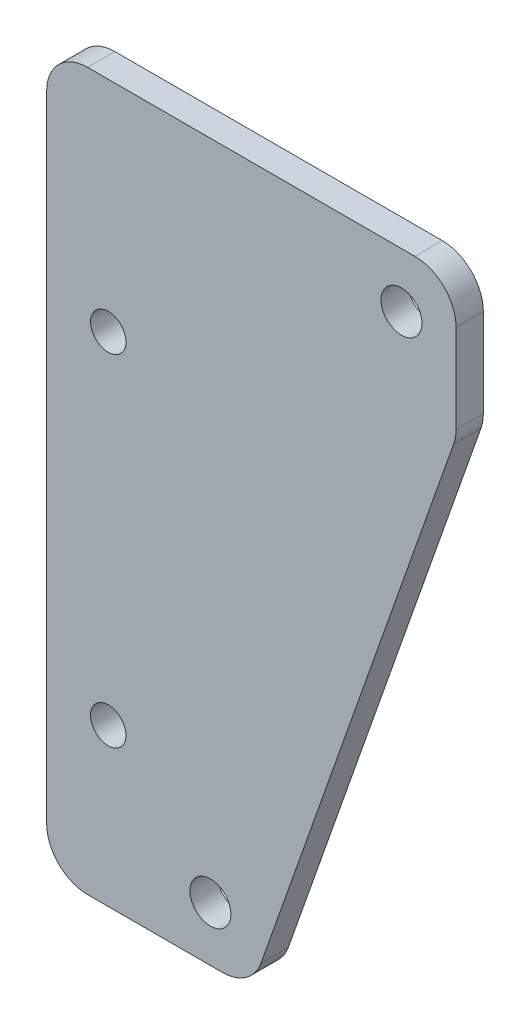
ISO-10303-21;
HEADER;
FILE_DESCRIPTION(('STEP AP214'),'2;1');
FILE_NAME('part.step','',(''),(''),'','','');
FILE_SCHEMA(('AUTOMOTIVE_DESIGN { 1 0 10303 214 1 1 1 1 }'));
ENDSEC;
DATA;
#1=APPLICATION_CONTEXT('core data for automotive mechanical design processes');
#2=APPLICATION_PROTOCOL_DEFINITION('international standard','automotive_design',2000,#1);
#3=PRODUCT_CONTEXT('',#1,'mechanical');
#4=PRODUCT('Part','Part','',(#3));
#5=PRODUCT_RELATED_PRODUCT_CATEGORY('part','',(#4));
#6=PRODUCT_DEFINITION_FORMATION('','',#4);
#7=PRODUCT_DEFINITION_CONTEXT('part definition',#1,'design');
#8=PRODUCT_DEFINITION('design','',#6,#7);
#9=PRODUCT_DEFINITION_SHAPE('','',#8);
#10=(LENGTH_UNIT() NAMED_UNIT(*) SI_UNIT(.MILLI.,.METRE.));
#11=(NAMED_UNIT(*) PLANE_ANGLE_UNIT() SI_UNIT($,.RADIAN.));
#12=(NAMED_UNIT(*) SI_UNIT($,.STERADIAN.) SOLID_ANGLE_UNIT());
#13=UNCERTAINTY_MEASURE_WITH_UNIT(LENGTH_MEASURE(1.E-05),#10,'distance_accuracy_value','');
#14=(GEOMETRIC_REPRESENTATION_CONTEXT(3) GLOBAL_UNCERTAINTY_ASSIGNED_CONTEXT((#13)) GLOBAL_UNIT_ASSIGNED_CONTEXT((#10,
#11,#12)) REPRESENTATION_CONTEXT('',''));
#15=CARTESIAN_POINT('',(0.,0.,0.));
#16=DIRECTION('',(0.,0.,1.));
#17=DIRECTION('',(1.,0.,0.));
#18=AXIS2_PLACEMENT_3D('',#15,#16,#17);
#19=CARTESIAN_POINT('',(0.,0.,2.));
#20=DIRECTION('',(0.,0.,1.));
#21=DIRECTION('',(1.,0.,0.));
#22=AXIS2_PLACEMENT_3D('',#19,#20,#21);
#23=PLANE('',#22);
#24=CARTESIAN_POINT('',(4.51504062206895,-41.,2.));
#25=DIRECTION('',(0.,0.,1.));
#26=DIRECTION('',(1.,0.,0.));
#27=AXIS2_PLACEMENT_3D('',#24,#25,#26);
#28=CIRCLE('',#27,1.3);
#29=CARTESIAN_POINT('',(5.81504062206895,-41.,2.));
#30=VERTEX_POINT('',#29);
#31=EDGE_CURVE('E222',#30,#30,#28,.T.);
#32=ORIENTED_EDGE('',*,*,#31,.F.);
#33=EDGE_LOOP('',(#32));
#34=FACE_BOUND('',#33,.T.);
#35=CARTESIAN_POINT('',(26.,-4.,2.));
#36=DIRECTION('',(0.,0.,1.));
#37=DIRECTION('',(1.,0.,0.));
#38=AXIS2_PLACEMENT_3D('',#35,#36,#37);
#39=CIRCLE('',#38,1.5);
#40=CARTESIAN_POINT('',(27.5,-4.,2.));
#41=VERTEX_POINT('',#40);
#42=EDGE_CURVE('E147',#41,#41,#39,.T.);
#43=ORIENTED_EDGE('',*,*,#42,.F.);
#44=EDGE_LOOP('',(#43));
#45=FACE_BOUND('',#44,.T.);
#46=DIRECTION('',(0.332820117735137,0.94299033358289,0.));
#47=VECTOR('',#46,1.);
#48=CARTESIAN_POINT('',(15.,-52.5,2.));
#49=LINE('',#48,#47);
#50=CARTESIAN_POINT('',(15.7064257576922,-50.4984603532054,2.));
#51=VERTEX_POINT('',#50);
#52=CARTESIAN_POINT('',(29.8289710007487,-10.4845821645454,2.));
#53=VERTEX_POINT('',#52);
#54=EDGE_CURVE('E156',#51,#53,#49,.T.);
#55=ORIENTED_EDGE('',*,*,#54,.T.);
#56=CARTESIAN_POINT('',(27.,-9.48612181134004,2.));
#57=DIRECTION('',(0.,0.,1.));
#58=DIRECTION('',(1.,0.,0.));
#59=AXIS2_PLACEMENT_3D('',#56,#57,#58);
#60=CIRCLE('',#59,3.);
#61=CARTESIAN_POINT('',(30.,-9.48612181134004,2.));
#62=VERTEX_POINT('',#61);
#63=EDGE_CURVE('E182',#53,#62,#60,.T.);
#64=ORIENTED_EDGE('',*,*,#63,.T.);
#65=DIRECTION('',(0.,1.,0.));
#66=VECTOR('',#65,1.);
#67=CARTESIAN_POINT('',(30.,-10.,2.));
#68=LINE('',#67,#66);
#69=CARTESIAN_POINT('',(30.,-3.,2.));
#70=VERTEX_POINT('',#69);
#71=EDGE_CURVE('E139',#62,#70,#68,.T.);
#72=ORIENTED_EDGE('',*,*,#71,.T.);
#73=CARTESIAN_POINT('',(27.,-3.,2.));
#74=DIRECTION('',(0.,0.,1.));
#75=DIRECTION('',(1.,0.,0.));
#76=AXIS2_PLACEMENT_3D('',#73,#74,#75);
#77=CIRCLE('',#76,3.);
#78=CARTESIAN_POINT('',(27.,0.,2.));
#79=VERTEX_POINT('',#78);
#80=EDGE_CURVE('E180',#70,#79,#77,.T.);
#81=ORIENTED_EDGE('',*,*,#80,.T.);
#82=DIRECTION('',(-1.,0.,0.));
#83=VECTOR('',#82,1.);
#84=CARTESIAN_POINT('',(30.,0.,2.));
#85=LINE('',#84,#83);
#86=CARTESIAN_POINT('',(3.,0.,2.));
#87=VERTEX_POINT('',#86);
#88=EDGE_CURVE('E210',#79,#87,#85,.T.);
#89=ORIENTED_EDGE('',*,*,#88,.T.);
#90=CARTESIAN_POINT('',(3.,-3.,2.));
#91=DIRECTION('',(0.,0.,1.));
#92=DIRECTION('',(1.,0.,0.));
#93=AXIS2_PLACEMENT_3D('',#90,#91,#92);
#94=CIRCLE('',#93,3.);
#95=CARTESIAN_POINT('',(0.,-3.,2.));
#96=VERTEX_POINT('',#95);
#97=EDGE_CURVE('E178',#87,#96,#94,.T.);
#98=ORIENTED_EDGE('',*,*,#97,.T.);
#99=DIRECTION('',(0.,-1.,0.));
#100=VECTOR('',#99,1.);
#101=CARTESIAN_POINT('',(0.,0.,2.));
#102=LINE('',#101,#100);
#103=CARTESIAN_POINT('',(0.,-49.5,2.));
#104=VERTEX_POINT('',#103);
#105=EDGE_CURVE('E199',#96,#104,#102,.T.);
#106=ORIENTED_EDGE('',*,*,#105,.T.);
#107=CARTESIAN_POINT('',(3.00000000000001,-49.5,2.));
#108=DIRECTION('',(0.,0.,1.));
#109=DIRECTION('',(1.,0.,0.));
#110=AXIS2_PLACEMENT_3D('',#107,#108,#109);
#111=CIRCLE('',#110,3.);
#112=CARTESIAN_POINT('',(3.00000000000001,-52.5,2.));
#113=VERTEX_POINT('',#112);
#114=EDGE_CURVE('E62',#104,#113,#111,.T.);
#115=ORIENTED_EDGE('',*,*,#114,.T.);
#116=DIRECTION('',(1.,0.,0.));
#117=VECTOR('',#116,1.);
#118=CARTESIAN_POINT('',(0.,-52.5,2.));
#119=LINE('',#118,#117);
#120=CARTESIAN_POINT('',(12.8774547569435,-52.5,2.));
#121=VERTEX_POINT('',#120);
#122=EDGE_CURVE('E207',#113,#121,#119,.T.);
#123=ORIENTED_EDGE('',*,*,#122,.T.);
#124=CARTESIAN_POINT('',(12.8774547569435,-49.5,2.));
#125=DIRECTION('',(0.,0.,1.));
#126=DIRECTION('',(1.,0.,0.));
#127=AXIS2_PLACEMENT_3D('',#124,#125,#126);
#128=CIRCLE('',#127,3.);
#129=EDGE_CURVE('E175',#121,#51,#128,.T.);
#130=ORIENTED_EDGE('',*,*,#129,.T.);
#131=EDGE_LOOP('',(#55,#64,#72,#81,#89,#98,#106,#115,#123,#130));
#132=FACE_BOUND('',#131,.T.);
#133=CARTESIAN_POINT('',(12.,-48.5,2.));
#134=DIRECTION('',(0.,0.,1.));
#135=DIRECTION('',(1.,0.,0.));
#136=AXIS2_PLACEMENT_3D('',#133,#134,#135);
#137=CIRCLE('',#136,1.5);
#138=CARTESIAN_POINT('',(13.5,-48.5,2.));
#139=VERTEX_POINT('',#138);
#140=EDGE_CURVE('E217',#139,#139,#137,.T.);
#141=ORIENTED_EDGE('',*,*,#140,.F.);
#142=EDGE_LOOP('',(#141));
#143=FACE_BOUND('',#142,.T.);
#144=CARTESIAN_POINT('',(4.51504062206895,-16.0288945453507,2.));
#145=DIRECTION('',(0.,0.,1.));
#146=DIRECTION('',(1.,0.,0.));
#147=AXIS2_PLACEMENT_3D('',#144,#145,#146);
#148=CIRCLE('',#147,1.3);
#149=CARTESIAN_POINT('',(5.81504062206895,-16.0288945453507,2.));
#150=VERTEX_POINT('',#149);
#151=EDGE_CURVE('E228',#150,#150,#148,.T.);
#152=ORIENTED_EDGE('',*,*,#151,.F.);
#153=EDGE_LOOP('',(#152));
#154=FACE_BOUND('',#153,.T.);
#155=ADVANCED_FACE('F41',(#34,#45,#132,#143,#154),#23,.T.);
#156=CARTESIAN_POINT('',(0.,0.,0.));
#157=DIRECTION('',(0.,0.,1.));
#158=DIRECTION('',(1.,0.,0.));
#159=AXIS2_PLACEMENT_3D('',#156,#157,#158);
#160=PLANE('',#159);
#161=DIRECTION('',(0.,1.,0.));
#162=VECTOR('',#161,1.);
#163=CARTESIAN_POINT('',(30.,-10.,0.));
#164=LINE('',#163,#162);
#165=CARTESIAN_POINT('',(30.,-9.48612181134004,0.));
#166=VERTEX_POINT('',#165);
#167=CARTESIAN_POINT('',(30.,-3.,0.));
#168=VERTEX_POINT('',#167);
#169=EDGE_CURVE('E136',#166,#168,#164,.T.);
#170=ORIENTED_EDGE('',*,*,#169,.F.);
#171=CARTESIAN_POINT('',(27.,-9.48612181134004,0.));
#172=DIRECTION('',(0.,0.,1.));
#173=DIRECTION('',(1.,0.,0.));
#174=AXIS2_PLACEMENT_3D('',#171,#172,#173);
#175=CIRCLE('',#174,3.);
#176=CARTESIAN_POINT('',(29.8289710007487,-10.4845821645454,0.));
#177=VERTEX_POINT('',#176);
#178=EDGE_CURVE('E119',#166,#177,#175,.F.);
#179=ORIENTED_EDGE('',*,*,#178,.T.);
#180=DIRECTION('',(0.332820117735137,0.94299033358289,0.));
#181=VECTOR('',#180,1.);
#182=CARTESIAN_POINT('',(15.,-52.5,0.));
#183=LINE('',#182,#181);
#184=CARTESIAN_POINT('',(15.7064257576922,-50.4984603532054,0.));
#185=VERTEX_POINT('',#184);
#186=EDGE_CURVE('E163',#185,#177,#183,.T.);
#187=ORIENTED_EDGE('',*,*,#186,.F.);
#188=CARTESIAN_POINT('',(12.8774547569435,-49.5,0.));
#189=DIRECTION('',(0.,0.,1.));
#190=DIRECTION('',(1.,0.,0.));
#191=AXIS2_PLACEMENT_3D('',#188,#189,#190);
#192=CIRCLE('',#191,3.);
#193=CARTESIAN_POINT('',(12.8774547569435,-52.5,0.));
#194=VERTEX_POINT('',#193);
#195=EDGE_CURVE('E140',#185,#194,#192,.F.);
#196=ORIENTED_EDGE('',*,*,#195,.T.);
#197=DIRECTION('',(1.,0.,0.));
#198=VECTOR('',#197,1.);
#199=CARTESIAN_POINT('',(0.,-52.5,0.));
#200=LINE('',#199,#198);
#201=CARTESIAN_POINT('',(3.00000000000001,-52.5,0.));
#202=VERTEX_POINT('',#201);
#203=EDGE_CURVE('E161',#202,#194,#200,.T.);
#204=ORIENTED_EDGE('',*,*,#203,.F.);
#205=CARTESIAN_POINT('',(3.00000000000001,-49.5,0.));
#206=DIRECTION('',(0.,0.,1.));
#207=DIRECTION('',(1.,0.,0.));
#208=AXIS2_PLACEMENT_3D('',#205,#206,#207);
#209=CIRCLE('',#208,3.);
#210=CARTESIAN_POINT('',(0.,-49.5,0.));
#211=VERTEX_POINT('',#210);
#212=EDGE_CURVE('E167',#202,#211,#209,.F.);
#213=ORIENTED_EDGE('',*,*,#212,.T.);
#214=DIRECTION('',(0.,-1.,0.));
#215=VECTOR('',#214,1.);
#216=CARTESIAN_POINT('',(0.,0.,0.));
#217=LINE('',#216,#215);
#218=CARTESIAN_POINT('',(0.,-3.,0.));
#219=VERTEX_POINT('',#218);
#220=EDGE_CURVE('E150',#219,#211,#217,.T.);
#221=ORIENTED_EDGE('',*,*,#220,.F.);
#222=CARTESIAN_POINT('',(3.,-3.,0.));
#223=DIRECTION('',(0.,0.,1.));
#224=DIRECTION('',(1.,0.,0.));
#225=AXIS2_PLACEMENT_3D('',#222,#223,#224);
#226=CIRCLE('',#225,3.);
#227=CARTESIAN_POINT('',(3.,0.,0.));
#228=VERTEX_POINT('',#227);
#229=EDGE_CURVE('E169',#219,#228,#226,.F.);
#230=ORIENTED_EDGE('',*,*,#229,.T.);
#231=DIRECTION('',(-1.,0.,0.));
#232=VECTOR('',#231,1.);
#233=CARTESIAN_POINT('',(30.,0.,0.));
#234=LINE('',#233,#232);
#235=CARTESIAN_POINT('',(27.,0.,0.));
#236=VERTEX_POINT('',#235);
#237=EDGE_CURVE('E146',#236,#228,#234,.T.);
#238=ORIENTED_EDGE('',*,*,#237,.F.);
#239=CARTESIAN_POINT('',(27.,-3.,0.));
#240=DIRECTION('',(0.,0.,1.));
#241=DIRECTION('',(1.,0.,0.));
#242=AXIS2_PLACEMENT_3D('',#239,#240,#241);
#243=CIRCLE('',#242,3.);
#244=EDGE_CURVE('E130',#236,#168,#243,.F.);
#245=ORIENTED_EDGE('',*,*,#244,.T.);
#246=EDGE_LOOP('',(#170,#179,#187,#196,#204,#213,#221,#230,#238,#245));
#247=FACE_BOUND('',#246,.T.);
#248=CARTESIAN_POINT('',(26.,-4.,0.));
#249=DIRECTION('',(0.,0.,1.));
#250=DIRECTION('',(1.,0.,0.));
#251=AXIS2_PLACEMENT_3D('',#248,#249,#250);
#252=CIRCLE('',#251,1.5);
#253=CARTESIAN_POINT('',(27.5,-4.,0.));
#254=VERTEX_POINT('',#253);
#255=EDGE_CURVE('E153',#254,#254,#252,.T.);
#256=ORIENTED_EDGE('',*,*,#255,.T.);
#257=EDGE_LOOP('',(#256));
#258=FACE_BOUND('',#257,.T.);
#259=CARTESIAN_POINT('',(12.,-48.5,0.));
#260=DIRECTION('',(0.,0.,1.));
#261=DIRECTION('',(1.,0.,0.));
#262=AXIS2_PLACEMENT_3D('',#259,#260,#261);
#263=CIRCLE('',#262,1.5);
#264=CARTESIAN_POINT('',(13.5,-48.5,0.));
#265=VERTEX_POINT('',#264);
#266=EDGE_CURVE('E219',#265,#265,#263,.T.);
#267=ORIENTED_EDGE('',*,*,#266,.T.);
#268=EDGE_LOOP('',(#267));
#269=FACE_BOUND('',#268,.T.);
#270=CARTESIAN_POINT('',(4.51504062206895,-41.,0.));
#271=DIRECTION('',(0.,0.,1.));
#272=DIRECTION('',(1.,0.,0.));
#273=AXIS2_PLACEMENT_3D('',#270,#271,#272);
#274=CIRCLE('',#273,1.3);
#275=CARTESIAN_POINT('',(5.81504062206895,-41.,0.));
#276=VERTEX_POINT('',#275);
#277=EDGE_CURVE('E225',#276,#276,#274,.T.);
#278=ORIENTED_EDGE('',*,*,#277,.T.);
#279=EDGE_LOOP('',(#278));
#280=FACE_BOUND('',#279,.T.);
#281=CARTESIAN_POINT('',(4.51504062206895,-16.0288945453507,0.));
#282=DIRECTION('',(0.,0.,1.));
#283=DIRECTION('',(1.,0.,0.));
#284=AXIS2_PLACEMENT_3D('',#281,#282,#283);
#285=CIRCLE('',#284,1.3);
#286=CARTESIAN_POINT('',(5.81504062206895,-16.0288945453507,0.));
#287=VERTEX_POINT('',#286);
#288=EDGE_CURVE('E231',#287,#287,#285,.T.);
#289=ORIENTED_EDGE('',*,*,#288,.T.);
#290=EDGE_LOOP('',(#289));
#291=FACE_BOUND('',#290,.T.);
#292=ADVANCED_FACE('F143',(#247,#258,#269,#280,#291),#160,.F.);
#293=CARTESIAN_POINT('',(30.,-10.,2.));
#294=DIRECTION('',(-1.,0.,0.));
#295=DIRECTION('',(0.,0.,1.));
#296=AXIS2_PLACEMENT_3D('',#293,#294,#295);
#297=PLANE('',#296);
#298=ORIENTED_EDGE('',*,*,#71,.F.);
#299=DIRECTION('',(0.,0.,-1.));
#300=VECTOR('',#299,1.);
#301=CARTESIAN_POINT('',(30.,-9.48612181134004,2.));
#302=LINE('',#301,#300);
#303=EDGE_CURVE('E123',#62,#166,#302,.T.);
#304=ORIENTED_EDGE('',*,*,#303,.T.);
#305=ORIENTED_EDGE('',*,*,#169,.T.);
#306=DIRECTION('',(0.,0.,-1.));
#307=VECTOR('',#306,1.);
#308=CARTESIAN_POINT('',(30.,-3.,2.));
#309=LINE('',#308,#307);
#310=EDGE_CURVE('E141',#168,#70,#309,.F.);
#311=ORIENTED_EDGE('',*,*,#310,.T.);
#312=EDGE_LOOP('',(#298,#304,#305,#311));
#313=FACE_BOUND('',#312,.T.);
#314=ADVANCED_FACE('F135',(#313),#297,.F.);
#315=CARTESIAN_POINT('',(30.,0.,2.));
#316=DIRECTION('',(0.,-1.,0.));
#317=DIRECTION('',(0.,0.,-1.));
#318=AXIS2_PLACEMENT_3D('',#315,#316,#317);
#319=PLANE('',#318);
#320=ORIENTED_EDGE('',*,*,#88,.F.);
#321=DIRECTION('',(0.,0.,-1.));
#322=VECTOR('',#321,1.);
#323=CARTESIAN_POINT('',(27.,0.,2.));
#324=LINE('',#323,#322);
#325=EDGE_CURVE('E186',#79,#236,#324,.T.);
#326=ORIENTED_EDGE('',*,*,#325,.T.);
#327=ORIENTED_EDGE('',*,*,#237,.T.);
#328=DIRECTION('',(0.,0.,-1.));
#329=VECTOR('',#328,1.);
#330=CARTESIAN_POINT('',(3.,0.,2.));
#331=LINE('',#330,#329);
#332=EDGE_CURVE('E184',#228,#87,#331,.F.);
#333=ORIENTED_EDGE('',*,*,#332,.T.);
#334=EDGE_LOOP('',(#320,#326,#327,#333));
#335=FACE_BOUND('',#334,.T.);
#336=ADVANCED_FACE('F261',(#335),#319,.F.);
#337=CARTESIAN_POINT('',(0.,0.,2.));
#338=DIRECTION('',(1.,0.,0.));
#339=DIRECTION('',(0.,1.,0.));
#340=AXIS2_PLACEMENT_3D('',#337,#338,#339);
#341=PLANE('',#340);
#342=ORIENTED_EDGE('',*,*,#105,.F.);
#343=DIRECTION('',(0.,0.,-1.));
#344=VECTOR('',#343,1.);
#345=CARTESIAN_POINT('',(0.,-3.,2.));
#346=LINE('',#345,#344);
#347=EDGE_CURVE('E191',#96,#219,#346,.T.);
#348=ORIENTED_EDGE('',*,*,#347,.T.);
#349=ORIENTED_EDGE('',*,*,#220,.T.);
#350=DIRECTION('',(0.,0.,-1.));
#351=VECTOR('',#350,1.);
#352=CARTESIAN_POINT('',(0.,-49.5,2.));
#353=LINE('',#352,#351);
#354=EDGE_CURVE('E189',#211,#104,#353,.F.);
#355=ORIENTED_EDGE('',*,*,#354,.T.);
#356=EDGE_LOOP('',(#342,#348,#349,#355));
#357=FACE_BOUND('',#356,.T.);
#358=ADVANCED_FACE('F197',(#357),#341,.F.);
#359=CARTESIAN_POINT('',(0.,-52.5,2.));
#360=DIRECTION('',(0.,1.,0.));
#361=DIRECTION('',(-1.,0.,0.));
#362=AXIS2_PLACEMENT_3D('',#359,#360,#361);
#363=PLANE('',#362);
#364=ORIENTED_EDGE('',*,*,#122,.F.);
#365=DIRECTION('',(0.,0.,-1.));
#366=VECTOR('',#365,1.);
#367=CARTESIAN_POINT('',(3.00000000000001,-52.5,2.));
#368=LINE('',#367,#366);
#369=EDGE_CURVE('E11',#113,#202,#368,.T.);
#370=ORIENTED_EDGE('',*,*,#369,.T.);
#371=ORIENTED_EDGE('',*,*,#203,.T.);
#372=DIRECTION('',(0.,0.,-1.));
#373=VECTOR('',#372,1.);
#374=CARTESIAN_POINT('',(12.8774547569435,-52.5,2.));
#375=LINE('',#374,#373);
#376=EDGE_CURVE('E49',#194,#121,#375,.F.);
#377=ORIENTED_EDGE('',*,*,#376,.T.);
#378=EDGE_LOOP('',(#364,#370,#371,#377));
#379=FACE_BOUND('',#378,.T.);
#380=ADVANCED_FACE('F206',(#379),#363,.F.);
#381=CARTESIAN_POINT('',(15.,-52.5,2.));
#382=DIRECTION('',(-0.94299033358289,0.332820117735137,0.));
#383=DIRECTION('',(-0.332820117735137,-0.94299033358289,0.));
#384=AXIS2_PLACEMENT_3D('',#381,#382,#383);
#385=PLANE('',#384);
#386=ORIENTED_EDGE('',*,*,#186,.T.);
#387=DIRECTION('',(0.,0.,-1.));
#388=VECTOR('',#387,1.);
#389=CARTESIAN_POINT('',(29.8289710007487,-10.4845821645454,2.));
#390=LINE('',#389,#388);
#391=EDGE_CURVE('E124',#177,#53,#390,.F.);
#392=ORIENTED_EDGE('',*,*,#391,.T.);
#393=ORIENTED_EDGE('',*,*,#54,.F.);
#394=DIRECTION('',(0.,0.,-1.));
#395=VECTOR('',#394,1.);
#396=CARTESIAN_POINT('',(15.7064257576922,-50.4984603532054,2.));
#397=LINE('',#396,#395);
#398=EDGE_CURVE('E129',#51,#185,#397,.T.);
#399=ORIENTED_EDGE('',*,*,#398,.T.);
#400=EDGE_LOOP('',(#386,#392,#393,#399));
#401=FACE_BOUND('',#400,.T.);
#402=ADVANCED_FACE('F253',(#401),#385,.F.);
#403=CARTESIAN_POINT('',(26.,-4.,2.));
#404=DIRECTION('',(0.,0.,-1.));
#405=DIRECTION('',(-1.,0.,0.));
#406=AXIS2_PLACEMENT_3D('',#403,#404,#405);
#407=CYLINDRICAL_SURFACE('',#406,1.5);
#408=ORIENTED_EDGE('',*,*,#42,.T.);
#409=EDGE_LOOP('',(#408));
#410=FACE_BOUND('',#409,.T.);
#411=ORIENTED_EDGE('',*,*,#255,.F.);
#412=EDGE_LOOP('',(#411));
#413=FACE_BOUND('',#412,.T.);
#414=ADVANCED_FACE('F250',(#410,#413),#407,.F.);
#415=CARTESIAN_POINT('',(12.,-48.5,2.));
#416=DIRECTION('',(0.,0.,-1.));
#417=DIRECTION('',(-1.,0.,0.));
#418=AXIS2_PLACEMENT_3D('',#415,#416,#417);
#419=CYLINDRICAL_SURFACE('',#418,1.5);
#420=ORIENTED_EDGE('',*,*,#140,.T.);
#421=EDGE_LOOP('',(#420));
#422=FACE_BOUND('',#421,.T.);
#423=ORIENTED_EDGE('',*,*,#266,.F.);
#424=EDGE_LOOP('',(#423));
#425=FACE_BOUND('',#424,.T.);
#426=ADVANCED_FACE('F291',(#422,#425),#419,.F.);
#427=CARTESIAN_POINT('',(4.51504062206895,-41.,2.));
#428=DIRECTION('',(0.,0.,-1.));
#429=DIRECTION('',(-1.,0.,0.));
#430=AXIS2_PLACEMENT_3D('',#427,#428,#429);
#431=CYLINDRICAL_SURFACE('',#430,1.3);
#432=ORIENTED_EDGE('',*,*,#31,.T.);
#433=EDGE_LOOP('',(#432));
#434=FACE_BOUND('',#433,.T.);
#435=ORIENTED_EDGE('',*,*,#277,.F.);
#436=EDGE_LOOP('',(#435));
#437=FACE_BOUND('',#436,.T.);
#438=ADVANCED_FACE('F294',(#434,#437),#431,.F.);
#439=CARTESIAN_POINT('',(4.51504062206895,-16.0288945453507,2.));
#440=DIRECTION('',(0.,0.,-1.));
#441=DIRECTION('',(-1.,0.,0.));
#442=AXIS2_PLACEMENT_3D('',#439,#440,#441);
#443=CYLINDRICAL_SURFACE('',#442,1.3);
#444=ORIENTED_EDGE('',*,*,#151,.T.);
#445=EDGE_LOOP('',(#444));
#446=FACE_BOUND('',#445,.T.);
#447=ORIENTED_EDGE('',*,*,#288,.F.);
#448=EDGE_LOOP('',(#447));
#449=FACE_BOUND('',#448,.T.);
#450=ADVANCED_FACE('F237',(#446,#449),#443,.F.);
#451=CARTESIAN_POINT('',(27.,-9.48612181134004,2.));
#452=DIRECTION('',(0.,0.,-1.));
#453=DIRECTION('',(-1.,0.,0.));
#454=AXIS2_PLACEMENT_3D('',#451,#452,#453);
#455=CYLINDRICAL_SURFACE('',#454,3.);
#456=ORIENTED_EDGE('',*,*,#63,.F.);
#457=ORIENTED_EDGE('',*,*,#391,.F.);
#458=ORIENTED_EDGE('',*,*,#178,.F.);
#459=ORIENTED_EDGE('',*,*,#303,.F.);
#460=EDGE_LOOP('',(#456,#457,#458,#459));
#461=FACE_BOUND('',#460,.T.);
#462=ADVANCED_FACE('F122',(#461),#455,.T.);
#463=CARTESIAN_POINT('',(27.,-3.,2.));
#464=DIRECTION('',(0.,0.,-1.));
#465=DIRECTION('',(-1.,0.,0.));
#466=AXIS2_PLACEMENT_3D('',#463,#464,#465);
#467=CYLINDRICAL_SURFACE('',#466,3.);
#468=ORIENTED_EDGE('',*,*,#80,.F.);
#469=ORIENTED_EDGE('',*,*,#310,.F.);
#470=ORIENTED_EDGE('',*,*,#244,.F.);
#471=ORIENTED_EDGE('',*,*,#325,.F.);
#472=EDGE_LOOP('',(#468,#469,#470,#471));
#473=FACE_BOUND('',#472,.T.);
#474=ADVANCED_FACE('F269',(#473),#467,.T.);
#475=CARTESIAN_POINT('',(3.,-3.,2.));
#476=DIRECTION('',(0.,0.,-1.));
#477=DIRECTION('',(-1.,0.,0.));
#478=AXIS2_PLACEMENT_3D('',#475,#476,#477);
#479=CYLINDRICAL_SURFACE('',#478,3.);
#480=ORIENTED_EDGE('',*,*,#97,.F.);
#481=ORIENTED_EDGE('',*,*,#332,.F.);
#482=ORIENTED_EDGE('',*,*,#229,.F.);
#483=ORIENTED_EDGE('',*,*,#347,.F.);
#484=EDGE_LOOP('',(#480,#481,#482,#483));
#485=FACE_BOUND('',#484,.T.);
#486=ADVANCED_FACE('F272',(#485),#479,.T.);
#487=CARTESIAN_POINT('',(3.00000000000001,-49.5,2.));
#488=DIRECTION('',(0.,0.,-1.));
#489=DIRECTION('',(-1.,0.,0.));
#490=AXIS2_PLACEMENT_3D('',#487,#488,#489);
#491=CYLINDRICAL_SURFACE('',#490,3.);
#492=ORIENTED_EDGE('',*,*,#114,.F.);
#493=ORIENTED_EDGE('',*,*,#354,.F.);
#494=ORIENTED_EDGE('',*,*,#212,.F.);
#495=ORIENTED_EDGE('',*,*,#369,.F.);
#496=EDGE_LOOP('',(#492,#493,#494,#495));
#497=FACE_BOUND('',#496,.T.);
#498=ADVANCED_FACE('F205',(#497),#491,.T.);
#499=CARTESIAN_POINT('',(12.8774547569435,-49.5,2.));
#500=DIRECTION('',(0.,0.,-1.));
#501=DIRECTION('',(-1.,0.,0.));
#502=AXIS2_PLACEMENT_3D('',#499,#500,#501);
#503=CYLINDRICAL_SURFACE('',#502,3.);
#504=ORIENTED_EDGE('',*,*,#129,.F.);
#505=ORIENTED_EDGE('',*,*,#376,.F.);
#506=ORIENTED_EDGE('',*,*,#195,.F.);
#507=ORIENTED_EDGE('',*,*,#398,.F.);
#508=EDGE_LOOP('',(#504,#505,#506,#507));
#509=FACE_BOUND('',#508,.T.);
#510=ADVANCED_FACE('F43',(#509),#503,.T.);
#511=CLOSED_SHELL('',(#155,#292,#314,#336,#358,#380,#402,#414,#426,#438,#450,#462,#474,#486,
#498,#510));
#512=MANIFOLD_SOLID_BREP('B2',#511);
#513=ADVANCED_BREP_SHAPE_REPRESENTATION('',(#18,#512),#14);
#514=SHAPE_DEFINITION_REPRESENTATION(#9,#513);
ENDSEC;
END-ISO-10303-21;
